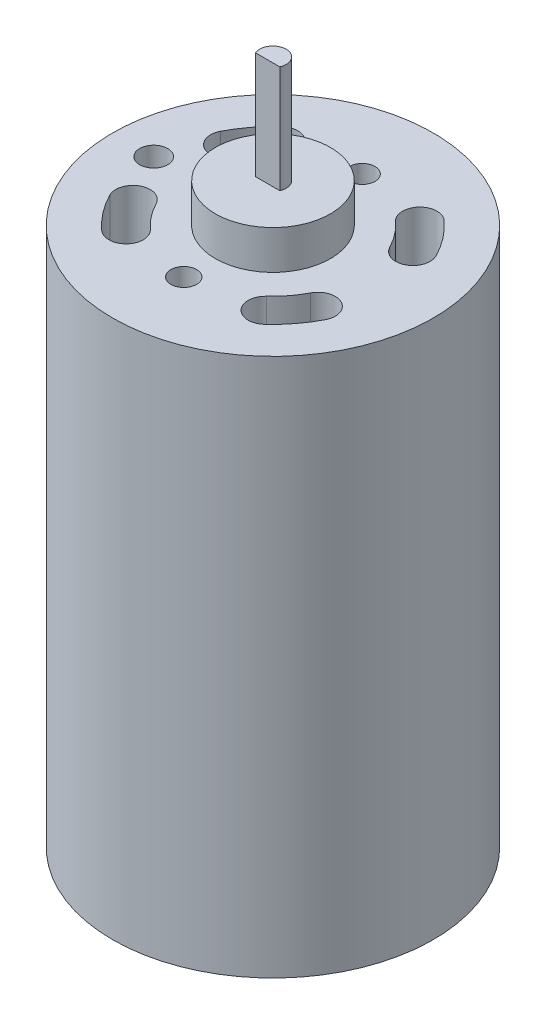
ISO-10303-21;
HEADER;
FILE_DESCRIPTION(('STEP AP214'),'2;1');
FILE_NAME('part.step','',(''),(''),'','','');
FILE_SCHEMA(('AUTOMOTIVE_DESIGN { 1 0 10303 214 1 1 1 1 }'));
ENDSEC;
DATA;
#1=APPLICATION_CONTEXT('core data for automotive mechanical design processes');
#2=APPLICATION_PROTOCOL_DEFINITION('international standard','automotive_design',2000,#1);
#3=PRODUCT_CONTEXT('',#1,'mechanical');
#4=PRODUCT('Part','Part','',(#3));
#5=PRODUCT_RELATED_PRODUCT_CATEGORY('part','',(#4));
#6=PRODUCT_DEFINITION_FORMATION('','',#4);
#7=PRODUCT_DEFINITION_CONTEXT('part definition',#1,'design');
#8=PRODUCT_DEFINITION('design','',#6,#7);
#9=PRODUCT_DEFINITION_SHAPE('','',#8);
#10=(LENGTH_UNIT() NAMED_UNIT(*) SI_UNIT(.MILLI.,.METRE.));
#11=(NAMED_UNIT(*) PLANE_ANGLE_UNIT() SI_UNIT($,.RADIAN.));
#12=(NAMED_UNIT(*) SI_UNIT($,.STERADIAN.) SOLID_ANGLE_UNIT());
#13=UNCERTAINTY_MEASURE_WITH_UNIT(LENGTH_MEASURE(1.E-05),#10,'distance_accuracy_value','');
#14=(GEOMETRIC_REPRESENTATION_CONTEXT(3) GLOBAL_UNCERTAINTY_ASSIGNED_CONTEXT((#13)) GLOBAL_UNIT_ASSIGNED_CONTEXT((#10,
#11,#12)) REPRESENTATION_CONTEXT('',''));
#15=CARTESIAN_POINT('',(0.,0.,0.));
#16=DIRECTION('',(0.,0.,1.));
#17=DIRECTION('',(1.,0.,0.));
#18=AXIS2_PLACEMENT_3D('',#15,#16,#17);
#19=CARTESIAN_POINT('',(3.99516824262446,41.0464,-2.047875));
#20=DIRECTION('',(0.,1.,0.));
#21=DIRECTION('',(0.,0.,1.));
#22=AXIS2_PLACEMENT_3D('',#19,#20,#21);
#23=PLANE('',#22);
#24=CARTESIAN_POINT('',(7.99033648524891,41.0464,-4.09575));
#25=DIRECTION('',(0.,-1.,0.));
#26=DIRECTION('',(0.,0.,1.));
#27=AXIS2_PLACEMENT_3D('',#24,#25,#26);
#28=CIRCLE('',#27,1.4859);
#29=CARTESIAN_POINT('',(9.3126411086918,41.0464,-4.77354738330976));
#30=VERTEX_POINT('',#29);
#31=CARTESIAN_POINT('',(6.66803186180602,41.0464,-3.41795261669024));
#32=VERTEX_POINT('',#31);
#33=EDGE_CURVE('E314',#30,#32,#28,.T.);
#34=ORIENTED_EDGE('',*,*,#33,.F.);
#35=CARTESIAN_POINT('',(0.,41.0464,0.));
#36=DIRECTION('',(0.,-1.,0.));
#37=DIRECTION('',(0.,0.,1.));
#38=AXIS2_PLACEMENT_3D('',#35,#36,#37);
#39=CIRCLE('',#38,10.4648);
#40=CARTESIAN_POINT('',(7.00894362377154,41.0464,-7.77089108910891));
#41=VERTEX_POINT('',#40);
#42=EDGE_CURVE('E292',#41,#30,#39,.T.);
#43=ORIENTED_EDGE('',*,*,#42,.F.);
#44=CARTESIAN_POINT('',(6.01374167719233,41.0464,-6.6675));
#45=DIRECTION('',(0.,-1.,0.));
#46=DIRECTION('',(0.,0.,1.));
#47=AXIS2_PLACEMENT_3D('',#44,#45,#46);
#48=CIRCLE('',#47,1.4859);
#49=CARTESIAN_POINT('',(5.01853973061311,41.0464,-5.56410891089109));
#50=VERTEX_POINT('',#49);
#51=EDGE_CURVE('E300',#50,#41,#48,.T.);
#52=ORIENTED_EDGE('',*,*,#51,.F.);
#53=CARTESIAN_POINT('',(0.,41.0464,0.));
#54=DIRECTION('',(0.,1.,0.));
#55=DIRECTION('',(0.,0.,1.));
#56=AXIS2_PLACEMENT_3D('',#53,#54,#55);
#57=CIRCLE('',#56,7.493);
#58=EDGE_CURVE('E307',#32,#50,#57,.T.);
#59=ORIENTED_EDGE('',*,*,#58,.F.);
#60=EDGE_LOOP('',(#34,#43,#52,#59));
#61=FACE_BOUND('',#60,.T.);
#62=ADVANCED_FACE('F41',(#61),#23,.T.);
#63=CARTESIAN_POINT('',(3.00687083859616,41.0464,3.33375));
#64=DIRECTION('',(0.,1.,0.));
#65=DIRECTION('',(0.,0.,1.));
#66=AXIS2_PLACEMENT_3D('',#63,#64,#65);
#67=PLANE('',#66);
#68=CARTESIAN_POINT('',(0.,41.0464,0.));
#69=DIRECTION('',(0.,1.,0.));
#70=DIRECTION('',(0.,0.,1.));
#71=AXIS2_PLACEMENT_3D('',#68,#69,#70);
#72=CIRCLE('',#71,7.493);
#73=CARTESIAN_POINT('',(5.01853973061312,41.0464,5.56410891089109));
#74=VERTEX_POINT('',#73);
#75=CARTESIAN_POINT('',(6.66803186180602,41.0464,3.41795261669024));
#76=VERTEX_POINT('',#75);
#77=EDGE_CURVE('E321',#74,#76,#72,.T.);
#78=ORIENTED_EDGE('',*,*,#77,.F.);
#79=CARTESIAN_POINT('',(6.01374167719233,41.0464,6.6675));
#80=DIRECTION('',(0.,-1.,0.));
#81=DIRECTION('',(0.,0.,1.));
#82=AXIS2_PLACEMENT_3D('',#79,#80,#81);
#83=CIRCLE('',#82,1.4859);
#84=CARTESIAN_POINT('',(7.00894362377154,41.0464,7.77089108910891));
#85=VERTEX_POINT('',#84);
#86=EDGE_CURVE('E329',#85,#74,#83,.T.);
#87=ORIENTED_EDGE('',*,*,#86,.F.);
#88=CARTESIAN_POINT('',(0.,41.0464,0.));
#89=DIRECTION('',(0.,-1.,0.));
#90=DIRECTION('',(0.,0.,1.));
#91=AXIS2_PLACEMENT_3D('',#88,#89,#90);
#92=CIRCLE('',#91,10.4648);
#93=CARTESIAN_POINT('',(9.3126411086918,41.0464,4.77354738330976));
#94=VERTEX_POINT('',#93);
#95=EDGE_CURVE('E336',#94,#85,#92,.T.);
#96=ORIENTED_EDGE('',*,*,#95,.F.);
#97=CARTESIAN_POINT('',(7.99033648524891,41.0464,4.09575));
#98=DIRECTION('',(0.,-1.,0.));
#99=DIRECTION('',(0.,0.,1.));
#100=AXIS2_PLACEMENT_3D('',#97,#98,#99);
#101=CIRCLE('',#100,1.4859);
#102=EDGE_CURVE('E11',#76,#94,#101,.T.);
#103=ORIENTED_EDGE('',*,*,#102,.F.);
#104=EDGE_LOOP('',(#78,#87,#96,#103));
#105=FACE_BOUND('',#104,.T.);
#106=ADVANCED_FACE('F356',(#105),#67,.T.);
#107=CARTESIAN_POINT('',(7.99033648524891,41.0464,4.09575));
#108=DIRECTION('',(0.,1.,0.));
#109=DIRECTION('',(0.,0.,1.));
#110=AXIS2_PLACEMENT_3D('',#107,#108,#109);
#111=CYLINDRICAL_SURFACE('',#110,1.4859);
#112=CARTESIAN_POINT('',(7.99033648524891,46.482,4.09575));
#113=DIRECTION('',(0.,-1.,0.));
#114=DIRECTION('',(0.,0.,1.));
#115=AXIS2_PLACEMENT_3D('',#112,#113,#114);
#116=CIRCLE('',#115,1.4859);
#117=CARTESIAN_POINT('',(6.66803186180602,46.482,3.41795261669024));
#118=VERTEX_POINT('',#117);
#119=CARTESIAN_POINT('',(9.3126411086918,46.482,4.77354738330976));
#120=VERTEX_POINT('',#119);
#121=EDGE_CURVE('E48',#118,#120,#116,.T.);
#122=ORIENTED_EDGE('',*,*,#121,.F.);
#123=DIRECTION('',(0.,1.,0.));
#124=VECTOR('',#123,1.);
#125=CARTESIAN_POINT('',(6.66803186180602,41.0464,3.41795261669024));
#126=LINE('',#125,#124);
#127=EDGE_CURVE('E318',#76,#118,#126,.T.);
#128=ORIENTED_EDGE('',*,*,#127,.F.);
#129=ORIENTED_EDGE('',*,*,#102,.T.);
#130=DIRECTION('',(0.,1.,0.));
#131=VECTOR('',#130,1.);
#132=CARTESIAN_POINT('',(9.3126411086918,41.0464,4.77354738330976));
#133=LINE('',#132,#131);
#134=EDGE_CURVE('E338',#94,#120,#133,.T.);
#135=ORIENTED_EDGE('',*,*,#134,.T.);
#136=EDGE_LOOP('',(#122,#128,#129,#135));
#137=FACE_BOUND('',#136,.T.);
#138=ADVANCED_FACE('F341',(#137),#111,.F.);
#139=CARTESIAN_POINT('',(0.,41.0464,0.));
#140=DIRECTION('',(0.,1.,0.));
#141=DIRECTION('',(0.,0.,1.));
#142=AXIS2_PLACEMENT_3D('',#139,#140,#141);
#143=CYLINDRICAL_SURFACE('',#142,10.4648);
#144=CARTESIAN_POINT('',(0.,46.482,0.));
#145=DIRECTION('',(0.,-1.,0.));
#146=DIRECTION('',(0.,0.,1.));
#147=AXIS2_PLACEMENT_3D('',#144,#145,#146);
#148=CIRCLE('',#147,10.4648);
#149=CARTESIAN_POINT('',(7.00894362377154,46.482,7.77089108910891));
#150=VERTEX_POINT('',#149);
#151=EDGE_CURVE('E334',#120,#150,#148,.T.);
#152=ORIENTED_EDGE('',*,*,#151,.F.);
#153=ORIENTED_EDGE('',*,*,#134,.F.);
#154=ORIENTED_EDGE('',*,*,#95,.T.);
#155=DIRECTION('',(0.,1.,0.));
#156=VECTOR('',#155,1.);
#157=CARTESIAN_POINT('',(7.00894362377154,41.0464,7.77089108910891));
#158=LINE('',#157,#156);
#159=EDGE_CURVE('E331',#85,#150,#158,.T.);
#160=ORIENTED_EDGE('',*,*,#159,.T.);
#161=EDGE_LOOP('',(#152,#153,#154,#160));
#162=FACE_BOUND('',#161,.T.);
#163=ADVANCED_FACE('F343',(#162),#143,.F.);
#164=CARTESIAN_POINT('',(6.01374167719233,41.0464,6.6675));
#165=DIRECTION('',(0.,1.,0.));
#166=DIRECTION('',(0.,0.,1.));
#167=AXIS2_PLACEMENT_3D('',#164,#165,#166);
#168=CYLINDRICAL_SURFACE('',#167,1.4859);
#169=CARTESIAN_POINT('',(6.01374167719233,46.482,6.6675));
#170=DIRECTION('',(0.,-1.,0.));
#171=DIRECTION('',(0.,0.,1.));
#172=AXIS2_PLACEMENT_3D('',#169,#170,#171);
#173=CIRCLE('',#172,1.4859);
#174=CARTESIAN_POINT('',(5.01853973061312,46.482,5.56410891089109));
#175=VERTEX_POINT('',#174);
#176=EDGE_CURVE('E327',#150,#175,#173,.T.);
#177=ORIENTED_EDGE('',*,*,#176,.F.);
#178=ORIENTED_EDGE('',*,*,#159,.F.);
#179=ORIENTED_EDGE('',*,*,#86,.T.);
#180=DIRECTION('',(0.,1.,0.));
#181=VECTOR('',#180,1.);
#182=CARTESIAN_POINT('',(5.01853973061312,41.0464,5.56410891089109));
#183=LINE('',#182,#181);
#184=EDGE_CURVE('E324',#74,#175,#183,.T.);
#185=ORIENTED_EDGE('',*,*,#184,.T.);
#186=EDGE_LOOP('',(#177,#178,#179,#185));
#187=FACE_BOUND('',#186,.T.);
#188=ADVANCED_FACE('F350',(#187),#168,.F.);
#189=CARTESIAN_POINT('',(0.,41.0464,0.));
#190=DIRECTION('',(0.,1.,0.));
#191=DIRECTION('',(0.,0.,1.));
#192=AXIS2_PLACEMENT_3D('',#189,#190,#191);
#193=CYLINDRICAL_SURFACE('',#192,7.493);
#194=CARTESIAN_POINT('',(0.,46.482,0.));
#195=DIRECTION('',(0.,1.,0.));
#196=DIRECTION('',(0.,0.,1.));
#197=AXIS2_PLACEMENT_3D('',#194,#195,#196);
#198=CIRCLE('',#197,7.493);
#199=EDGE_CURVE('E316',#175,#118,#198,.T.);
#200=ORIENTED_EDGE('',*,*,#199,.F.);
#201=ORIENTED_EDGE('',*,*,#184,.F.);
#202=ORIENTED_EDGE('',*,*,#77,.T.);
#203=ORIENTED_EDGE('',*,*,#127,.T.);
#204=EDGE_LOOP('',(#200,#201,#202,#203));
#205=FACE_BOUND('',#204,.T.);
#206=ADVANCED_FACE('F354',(#205),#193,.T.);
#207=CARTESIAN_POINT('',(7.99033648524891,41.0464,-4.09575));
#208=DIRECTION('',(0.,1.,0.));
#209=DIRECTION('',(0.,0.,1.));
#210=AXIS2_PLACEMENT_3D('',#207,#208,#209);
#211=CYLINDRICAL_SURFACE('',#210,1.4859);
#212=CARTESIAN_POINT('',(7.99033648524891,46.482,-4.09575));
#213=DIRECTION('',(0.,-1.,0.));
#214=DIRECTION('',(0.,0.,1.));
#215=AXIS2_PLACEMENT_3D('',#212,#213,#214);
#216=CIRCLE('',#215,1.4859);
#217=CARTESIAN_POINT('',(9.3126411086918,46.482,-4.77354738330976));
#218=VERTEX_POINT('',#217);
#219=CARTESIAN_POINT('',(6.66803186180602,46.482,-3.41795261669024));
#220=VERTEX_POINT('',#219);
#221=EDGE_CURVE('E312',#218,#220,#216,.T.);
#222=ORIENTED_EDGE('',*,*,#221,.F.);
#223=DIRECTION('',(0.,1.,0.));
#224=VECTOR('',#223,1.);
#225=CARTESIAN_POINT('',(9.3126411086918,41.0464,-4.77354738330976));
#226=LINE('',#225,#224);
#227=EDGE_CURVE('E289',#30,#218,#226,.T.);
#228=ORIENTED_EDGE('',*,*,#227,.F.);
#229=ORIENTED_EDGE('',*,*,#33,.T.);
#230=DIRECTION('',(0.,1.,0.));
#231=VECTOR('',#230,1.);
#232=CARTESIAN_POINT('',(6.66803186180602,41.0464,-3.41795261669024));
#233=LINE('',#232,#231);
#234=EDGE_CURVE('E309',#32,#220,#233,.T.);
#235=ORIENTED_EDGE('',*,*,#234,.T.);
#236=EDGE_LOOP('',(#222,#228,#229,#235));
#237=FACE_BOUND('',#236,.T.);
#238=ADVANCED_FACE('F371',(#237),#211,.F.);
#239=CARTESIAN_POINT('',(0.,41.0464,0.));
#240=DIRECTION('',(0.,1.,0.));
#241=DIRECTION('',(0.,0.,1.));
#242=AXIS2_PLACEMENT_3D('',#239,#240,#241);
#243=CYLINDRICAL_SURFACE('',#242,7.493);
#244=CARTESIAN_POINT('',(0.,46.482,0.));
#245=DIRECTION('',(0.,1.,0.));
#246=DIRECTION('',(0.,0.,1.));
#247=AXIS2_PLACEMENT_3D('',#244,#245,#246);
#248=CIRCLE('',#247,7.493);
#249=CARTESIAN_POINT('',(5.01853973061311,46.482,-5.56410891089109));
#250=VERTEX_POINT('',#249);
#251=EDGE_CURVE('E305',#220,#250,#248,.T.);
#252=ORIENTED_EDGE('',*,*,#251,.F.);
#253=ORIENTED_EDGE('',*,*,#234,.F.);
#254=ORIENTED_EDGE('',*,*,#58,.T.);
#255=DIRECTION('',(0.,1.,0.));
#256=VECTOR('',#255,1.);
#257=CARTESIAN_POINT('',(5.01853973061311,41.0464,-5.56410891089109));
#258=LINE('',#257,#256);
#259=EDGE_CURVE('E302',#50,#250,#258,.T.);
#260=ORIENTED_EDGE('',*,*,#259,.T.);
#261=EDGE_LOOP('',(#252,#253,#254,#260));
#262=FACE_BOUND('',#261,.T.);
#263=ADVANCED_FACE('F374',(#262),#243,.T.);
#264=CARTESIAN_POINT('',(6.01374167719233,41.0464,-6.6675));
#265=DIRECTION('',(0.,1.,0.));
#266=DIRECTION('',(0.,0.,1.));
#267=AXIS2_PLACEMENT_3D('',#264,#265,#266);
#268=CYLINDRICAL_SURFACE('',#267,1.4859);
#269=CARTESIAN_POINT('',(6.01374167719233,46.482,-6.6675));
#270=DIRECTION('',(0.,-1.,0.));
#271=DIRECTION('',(0.,0.,1.));
#272=AXIS2_PLACEMENT_3D('',#269,#270,#271);
#273=CIRCLE('',#272,1.4859);
#274=CARTESIAN_POINT('',(7.00894362377154,46.482,-7.77089108910891));
#275=VERTEX_POINT('',#274);
#276=EDGE_CURVE('E298',#250,#275,#273,.T.);
#277=ORIENTED_EDGE('',*,*,#276,.F.);
#278=ORIENTED_EDGE('',*,*,#259,.F.);
#279=ORIENTED_EDGE('',*,*,#51,.T.);
#280=DIRECTION('',(0.,1.,0.));
#281=VECTOR('',#280,1.);
#282=CARTESIAN_POINT('',(7.00894362377154,41.0464,-7.77089108910891));
#283=LINE('',#282,#281);
#284=EDGE_CURVE('E295',#41,#275,#283,.T.);
#285=ORIENTED_EDGE('',*,*,#284,.T.);
#286=EDGE_LOOP('',(#277,#278,#279,#285));
#287=FACE_BOUND('',#286,.T.);
#288=ADVANCED_FACE('F378',(#287),#268,.F.);
#289=CARTESIAN_POINT('',(0.,41.0464,0.));
#290=DIRECTION('',(0.,1.,0.));
#291=DIRECTION('',(0.,0.,1.));
#292=AXIS2_PLACEMENT_3D('',#289,#290,#291);
#293=CYLINDRICAL_SURFACE('',#292,10.4648);
#294=CARTESIAN_POINT('',(0.,46.482,0.));
#295=DIRECTION('',(0.,-1.,0.));
#296=DIRECTION('',(0.,0.,1.));
#297=AXIS2_PLACEMENT_3D('',#294,#295,#296);
#298=CIRCLE('',#297,10.4648);
#299=EDGE_CURVE('E275',#275,#218,#298,.T.);
#300=ORIENTED_EDGE('',*,*,#299,.F.);
#301=ORIENTED_EDGE('',*,*,#284,.F.);
#302=ORIENTED_EDGE('',*,*,#42,.T.);
#303=ORIENTED_EDGE('',*,*,#227,.T.);
#304=EDGE_LOOP('',(#300,#301,#302,#303));
#305=FACE_BOUND('',#304,.T.);
#306=ADVANCED_FACE('F382',(#305),#293,.F.);
#307=CARTESIAN_POINT('',(0.,46.482,0.));
#308=DIRECTION('',(0.,-1.,0.));
#309=DIRECTION('',(0.,0.,-1.));
#310=AXIS2_PLACEMENT_3D('',#307,#308,#309);
#311=CYLINDRICAL_SURFACE('',#310,13.843);
#312=CARTESIAN_POINT('',(0.,46.482,0.));
#313=DIRECTION('',(0.,1.,0.));
#314=DIRECTION('',(0.,0.,1.));
#315=AXIS2_PLACEMENT_3D('',#312,#313,#314);
#316=CIRCLE('',#315,13.843);
#317=CARTESIAN_POINT('',(0.,46.482,13.843));
#318=VERTEX_POINT('',#317);
#319=EDGE_CURVE('E282',#318,#318,#316,.T.);
#320=ORIENTED_EDGE('',*,*,#319,.F.);
#321=EDGE_LOOP('',(#320));
#322=FACE_BOUND('',#321,.T.);
#323=CARTESIAN_POINT('',(0.,0.,0.));
#324=DIRECTION('',(0.,1.,0.));
#325=DIRECTION('',(0.,0.,1.));
#326=AXIS2_PLACEMENT_3D('',#323,#324,#325);
#327=CIRCLE('',#326,13.843);
#328=CARTESIAN_POINT('',(0.,0.,13.843));
#329=VERTEX_POINT('',#328);
#330=EDGE_CURVE('E279',#329,#329,#327,.T.);
#331=ORIENTED_EDGE('',*,*,#330,.T.);
#332=EDGE_LOOP('',(#331));
#333=FACE_BOUND('',#332,.T.);
#334=ADVANCED_FACE('F386',(#322,#333),#311,.T.);
#335=CARTESIAN_POINT('',(0.,46.482,0.));
#336=DIRECTION('',(0.,1.,0.));
#337=DIRECTION('',(0.,0.,1.));
#338=AXIS2_PLACEMENT_3D('',#335,#336,#337);
#339=PLANE('',#338);
#340=ORIENTED_EDGE('',*,*,#221,.T.);
#341=ORIENTED_EDGE('',*,*,#251,.T.);
#342=ORIENTED_EDGE('',*,*,#276,.T.);
#343=ORIENTED_EDGE('',*,*,#299,.T.);
#344=EDGE_LOOP('',(#340,#341,#342,#343));
#345=FACE_BOUND('',#344,.T.);
#346=ORIENTED_EDGE('',*,*,#199,.T.);
#347=ORIENTED_EDGE('',*,*,#121,.T.);
#348=ORIENTED_EDGE('',*,*,#151,.T.);
#349=ORIENTED_EDGE('',*,*,#176,.T.);
#350=EDGE_LOOP('',(#346,#347,#348,#349));
#351=FACE_BOUND('',#350,.T.);
#352=CARTESIAN_POINT('',(0.,46.482,7.70255));
#353=DIRECTION('',(0.,1.,0.));
#354=DIRECTION('',(0.,0.,1.));
#355=AXIS2_PLACEMENT_3D('',#352,#353,#354);
#356=CIRCLE('',#355,1.11125);
#357=CARTESIAN_POINT('',(0.,46.482,8.8138));
#358=VERTEX_POINT('',#357);
#359=EDGE_CURVE('E237',#358,#358,#356,.T.);
#360=ORIENTED_EDGE('',*,*,#359,.F.);
#361=EDGE_LOOP('',(#360));
#362=FACE_BOUND('',#361,.T.);
#363=CARTESIAN_POINT('',(-10.29335,46.482,0.));
#364=DIRECTION('',(0.,1.,0.));
#365=DIRECTION('',(0.,0.,1.));
#366=AXIS2_PLACEMENT_3D('',#363,#364,#365);
#367=CIRCLE('',#366,1.21285);
#368=CARTESIAN_POINT('',(-10.29335,46.482,1.21285));
#369=VERTEX_POINT('',#368);
#370=EDGE_CURVE('E191',#369,#369,#367,.T.);
#371=ORIENTED_EDGE('',*,*,#370,.F.);
#372=EDGE_LOOP('',(#371));
#373=FACE_BOUND('',#372,.T.);
#374=CARTESIAN_POINT('',(0.,46.482,0.));
#375=DIRECTION('',(0.,-1.,0.));
#376=DIRECTION('',(0.,0.,1.));
#377=AXIS2_PLACEMENT_3D('',#374,#375,#376);
#378=CIRCLE('',#377,7.493);
#379=CARTESIAN_POINT('',(-5.01853973061312,46.482,5.56410891089109));
#380=VERTEX_POINT('',#379);
#381=CARTESIAN_POINT('',(-6.66803186180602,46.482,3.41795261669024));
#382=VERTEX_POINT('',#381);
#383=EDGE_CURVE('E165',#380,#382,#378,.T.);
#384=ORIENTED_EDGE('',*,*,#383,.F.);
#385=CARTESIAN_POINT('',(-6.01374167719233,46.482,6.6675));
#386=DIRECTION('',(0.,1.,0.));
#387=DIRECTION('',(0.,0.,1.));
#388=AXIS2_PLACEMENT_3D('',#385,#386,#387);
#389=CIRCLE('',#388,1.4859);
#390=CARTESIAN_POINT('',(-7.00894362377154,46.482,7.77089108910891));
#391=VERTEX_POINT('',#390);
#392=EDGE_CURVE('E176',#391,#380,#389,.T.);
#393=ORIENTED_EDGE('',*,*,#392,.F.);
#394=CARTESIAN_POINT('',(0.,46.482,0.));
#395=DIRECTION('',(0.,1.,0.));
#396=DIRECTION('',(0.,0.,1.));
#397=AXIS2_PLACEMENT_3D('',#394,#395,#396);
#398=CIRCLE('',#397,10.4648);
#399=CARTESIAN_POINT('',(-9.3126411086918,46.482,4.77354738330976));
#400=VERTEX_POINT('',#399);
#401=EDGE_CURVE('E181',#400,#391,#398,.T.);
#402=ORIENTED_EDGE('',*,*,#401,.F.);
#403=CARTESIAN_POINT('',(-7.99033648524891,46.482,4.09575));
#404=DIRECTION('',(0.,1.,0.));
#405=DIRECTION('',(0.,0.,1.));
#406=AXIS2_PLACEMENT_3D('',#403,#404,#405);
#407=CIRCLE('',#406,1.4859);
#408=EDGE_CURVE('E187',#382,#400,#407,.T.);
#409=ORIENTED_EDGE('',*,*,#408,.F.);
#410=EDGE_LOOP('',(#384,#393,#402,#409));
#411=FACE_BOUND('',#410,.T.);
#412=CARTESIAN_POINT('',(-7.99033648524891,46.482,-4.09575));
#413=DIRECTION('',(0.,1.,0.));
#414=DIRECTION('',(0.,0.,1.));
#415=AXIS2_PLACEMENT_3D('',#412,#413,#414);
#416=CIRCLE('',#415,1.4859);
#417=CARTESIAN_POINT('',(-9.3126411086918,46.482,-4.77354738330976));
#418=VERTEX_POINT('',#417);
#419=CARTESIAN_POINT('',(-6.66803186180602,46.482,-3.41795261669024));
#420=VERTEX_POINT('',#419);
#421=EDGE_CURVE('E173',#418,#420,#416,.T.);
#422=ORIENTED_EDGE('',*,*,#421,.F.);
#423=CARTESIAN_POINT('',(0.,46.482,0.));
#424=DIRECTION('',(0.,1.,0.));
#425=DIRECTION('',(0.,0.,1.));
#426=AXIS2_PLACEMENT_3D('',#423,#424,#425);
#427=CIRCLE('',#426,10.4648);
#428=CARTESIAN_POINT('',(-7.00894362377154,46.482,-7.77089108910891));
#429=VERTEX_POINT('',#428);
#430=EDGE_CURVE('E216',#429,#418,#427,.T.);
#431=ORIENTED_EDGE('',*,*,#430,.F.);
#432=CARTESIAN_POINT('',(-6.01374167719233,46.482,-6.6675));
#433=DIRECTION('',(0.,1.,0.));
#434=DIRECTION('',(0.,0.,1.));
#435=AXIS2_PLACEMENT_3D('',#432,#433,#434);
#436=CIRCLE('',#435,1.4859);
#437=CARTESIAN_POINT('',(-5.01853973061311,46.482,-5.56410891089109));
#438=VERTEX_POINT('',#437);
#439=EDGE_CURVE('E219',#438,#429,#436,.T.);
#440=ORIENTED_EDGE('',*,*,#439,.F.);
#441=CARTESIAN_POINT('',(0.,46.482,0.));
#442=DIRECTION('',(0.,-1.,0.));
#443=DIRECTION('',(0.,0.,1.));
#444=AXIS2_PLACEMENT_3D('',#441,#442,#443);
#445=CIRCLE('',#444,7.493);
#446=EDGE_CURVE('E223',#420,#438,#445,.T.);
#447=ORIENTED_EDGE('',*,*,#446,.F.);
#448=EDGE_LOOP('',(#422,#431,#440,#447));
#449=FACE_BOUND('',#448,.T.);
#450=CARTESIAN_POINT('',(0.,46.482,-7.70255));
#451=DIRECTION('',(0.,1.,0.));
#452=DIRECTION('',(0.,0.,1.));
#453=AXIS2_PLACEMENT_3D('',#450,#451,#452);
#454=CIRCLE('',#453,1.11125);
#455=CARTESIAN_POINT('',(0.,46.482,-6.5913));
#456=VERTEX_POINT('',#455);
#457=EDGE_CURVE('E240',#456,#456,#454,.T.);
#458=ORIENTED_EDGE('',*,*,#457,.F.);
#459=EDGE_LOOP('',(#458));
#460=FACE_BOUND('',#459,.T.);
#461=CARTESIAN_POINT('',(0.,46.482,0.));
#462=DIRECTION('',(0.,1.,0.));
#463=DIRECTION('',(0.,0.,1.));
#464=AXIS2_PLACEMENT_3D('',#461,#462,#463);
#465=CIRCLE('',#464,4.9657);
#466=CARTESIAN_POINT('',(0.,46.482,4.9657));
#467=VERTEX_POINT('',#466);
#468=EDGE_CURVE('E276',#467,#467,#465,.T.);
#469=ORIENTED_EDGE('',*,*,#468,.F.);
#470=EDGE_LOOP('',(#469));
#471=FACE_BOUND('',#470,.T.);
#472=ORIENTED_EDGE('',*,*,#319,.T.);
#473=EDGE_LOOP('',(#472));
#474=FACE_BOUND('',#473,.T.);
#475=ADVANCED_FACE('F184',(#345,#351,#362,#373,#411,#449,#460,#471,#474),#339,.T.);
#476=CARTESIAN_POINT('',(0.,0.,0.));
#477=DIRECTION('',(0.,1.,0.));
#478=DIRECTION('',(0.,0.,1.));
#479=AXIS2_PLACEMENT_3D('',#476,#477,#478);
#480=PLANE('',#479);
#481=CARTESIAN_POINT('',(0.,0.,0.));
#482=DIRECTION('',(0.,-1.,0.));
#483=DIRECTION('',(0.,0.,-1.));
#484=AXIS2_PLACEMENT_3D('',#481,#482,#483);
#485=CIRCLE('',#484,4.953);
#486=CARTESIAN_POINT('',(0.,0.,-4.953));
#487=VERTEX_POINT('',#486);
#488=EDGE_CURVE('E272',#487,#487,#485,.T.);
#489=ORIENTED_EDGE('',*,*,#488,.F.);
#490=EDGE_LOOP('',(#489));
#491=FACE_BOUND('',#490,.T.);
#492=ORIENTED_EDGE('',*,*,#330,.F.);
#493=EDGE_LOOP('',(#492));
#494=FACE_BOUND('',#493,.T.);
#495=ADVANCED_FACE('F391',(#491,#494),#480,.F.);
#496=CARTESIAN_POINT('',(0.,49.8348,0.));
#497=DIRECTION('',(0.,-1.,0.));
#498=DIRECTION('',(0.,0.,-1.));
#499=AXIS2_PLACEMENT_3D('',#496,#497,#498);
#500=CYLINDRICAL_SURFACE('',#499,4.9657);
#501=CARTESIAN_POINT('',(0.,49.8348,0.));
#502=DIRECTION('',(0.,1.,0.));
#503=DIRECTION('',(0.,0.,1.));
#504=AXIS2_PLACEMENT_3D('',#501,#502,#503);
#505=CIRCLE('',#504,4.9657);
#506=CARTESIAN_POINT('',(0.,49.8348,4.9657));
#507=VERTEX_POINT('',#506);
#508=EDGE_CURVE('E271',#507,#507,#505,.T.);
#509=ORIENTED_EDGE('',*,*,#508,.F.);
#510=EDGE_LOOP('',(#509));
#511=FACE_BOUND('',#510,.T.);
#512=ORIENTED_EDGE('',*,*,#468,.T.);
#513=EDGE_LOOP('',(#512));
#514=FACE_BOUND('',#513,.T.);
#515=ADVANCED_FACE('F394',(#511,#514),#500,.T.);
#516=CARTESIAN_POINT('',(0.,49.8348,0.));
#517=DIRECTION('',(0.,1.,0.));
#518=DIRECTION('',(0.,0.,1.));
#519=AXIS2_PLACEMENT_3D('',#516,#517,#518);
#520=PLANE('',#519);
#521=CARTESIAN_POINT('',(0.,49.8348,0.));
#522=DIRECTION('',(0.,1.,0.));
#523=DIRECTION('',(0.,0.,1.));
#524=AXIS2_PLACEMENT_3D('',#521,#522,#523);
#525=CIRCLE('',#524,1.143);
#526=CARTESIAN_POINT('',(1.04757680386691,49.8348,0.4572));
#527=VERTEX_POINT('',#526);
#528=CARTESIAN_POINT('',(-1.04757680386691,49.8348,0.4572));
#529=VERTEX_POINT('',#528);
#530=EDGE_CURVE('E249',#527,#529,#525,.T.);
#531=ORIENTED_EDGE('',*,*,#530,.F.);
#532=DIRECTION('',(1.,0.,0.));
#533=VECTOR('',#532,1.);
#534=CARTESIAN_POINT('',(-1.04757680386691,49.8348,0.4572));
#535=LINE('',#534,#533);
#536=EDGE_CURVE('E256',#529,#527,#535,.T.);
#537=ORIENTED_EDGE('',*,*,#536,.F.);
#538=EDGE_LOOP('',(#531,#537));
#539=FACE_BOUND('',#538,.T.);
#540=ORIENTED_EDGE('',*,*,#508,.T.);
#541=EDGE_LOOP('',(#540));
#542=FACE_BOUND('',#541,.T.);
#543=ADVANCED_FACE('F401',(#539,#542),#520,.T.);
#544=CARTESIAN_POINT('',(0.,-2.8956,0.));
#545=DIRECTION('',(0.,1.,0.));
#546=DIRECTION('',(0.,0.,1.));
#547=AXIS2_PLACEMENT_3D('',#544,#545,#546);
#548=CYLINDRICAL_SURFACE('',#547,4.953);
#549=CARTESIAN_POINT('',(0.,-2.8956,0.));
#550=DIRECTION('',(0.,-1.,0.));
#551=DIRECTION('',(0.,0.,-1.));
#552=AXIS2_PLACEMENT_3D('',#549,#550,#551);
#553=CIRCLE('',#552,4.953);
#554=CARTESIAN_POINT('',(0.,-2.8956,-4.953));
#555=VERTEX_POINT('',#554);
#556=EDGE_CURVE('E268',#555,#555,#553,.T.);
#557=ORIENTED_EDGE('',*,*,#556,.F.);
#558=EDGE_LOOP('',(#557));
#559=FACE_BOUND('',#558,.T.);
#560=ORIENTED_EDGE('',*,*,#488,.T.);
#561=EDGE_LOOP('',(#560));
#562=FACE_BOUND('',#561,.T.);
#563=ADVANCED_FACE('F405',(#559,#562),#548,.T.);
#564=CARTESIAN_POINT('',(0.,-2.8956,0.));
#565=DIRECTION('',(0.,-1.,0.));
#566=DIRECTION('',(0.,0.,-1.));
#567=AXIS2_PLACEMENT_3D('',#564,#565,#566);
#568=PLANE('',#567);
#569=ORIENTED_EDGE('',*,*,#556,.T.);
#570=EDGE_LOOP('',(#569));
#571=FACE_BOUND('',#570,.T.);
#572=ADVANCED_FACE('F409',(#571),#568,.T.);
#573=CARTESIAN_POINT('',(0.,59.0931,0.));
#574=DIRECTION('',(0.,-1.,0.));
#575=DIRECTION('',(0.,0.,-1.));
#576=AXIS2_PLACEMENT_3D('',#573,#574,#575);
#577=CYLINDRICAL_SURFACE('',#576,1.143);
#578=ORIENTED_EDGE('',*,*,#530,.T.);
#579=DIRECTION('',(0.,-1.,0.));
#580=VECTOR('',#579,1.);
#581=CARTESIAN_POINT('',(-1.04757680386691,59.0931,0.4572));
#582=LINE('',#581,#580);
#583=CARTESIAN_POINT('',(-1.04757680386691,59.0931,0.4572));
#584=VERTEX_POINT('',#583);
#585=EDGE_CURVE('E265',#584,#529,#582,.T.);
#586=ORIENTED_EDGE('',*,*,#585,.F.);
#587=CARTESIAN_POINT('',(0.,59.0931,0.));
#588=DIRECTION('',(0.,1.,0.));
#589=DIRECTION('',(0.,0.,1.));
#590=AXIS2_PLACEMENT_3D('',#587,#588,#589);
#591=CIRCLE('',#590,1.143);
#592=CARTESIAN_POINT('',(1.04757680386691,59.0931,0.4572));
#593=VERTEX_POINT('',#592);
#594=EDGE_CURVE('E252',#593,#584,#591,.T.);
#595=ORIENTED_EDGE('',*,*,#594,.F.);
#596=DIRECTION('',(0.,-1.,0.));
#597=VECTOR('',#596,1.);
#598=CARTESIAN_POINT('',(1.04757680386691,59.0931,0.4572));
#599=LINE('',#598,#597);
#600=EDGE_CURVE('E258',#593,#527,#599,.T.);
#601=ORIENTED_EDGE('',*,*,#600,.T.);
#602=EDGE_LOOP('',(#578,#586,#595,#601));
#603=FACE_BOUND('',#602,.T.);
#604=ADVANCED_FACE('F413',(#603),#577,.T.);
#605=CARTESIAN_POINT('',(-1.04757680386691,59.0931,0.4572));
#606=DIRECTION('',(0.,0.,-1.));
#607=DIRECTION('',(-1.,0.,0.));
#608=AXIS2_PLACEMENT_3D('',#605,#606,#607);
#609=PLANE('',#608);
#610=ORIENTED_EDGE('',*,*,#536,.T.);
#611=ORIENTED_EDGE('',*,*,#600,.F.);
#612=DIRECTION('',(1.,0.,0.));
#613=VECTOR('',#612,1.);
#614=CARTESIAN_POINT('',(-1.04757680386691,59.0931,0.4572));
#615=LINE('',#614,#613);
#616=EDGE_CURVE('E255',#584,#593,#615,.T.);
#617=ORIENTED_EDGE('',*,*,#616,.F.);
#618=ORIENTED_EDGE('',*,*,#585,.T.);
#619=EDGE_LOOP('',(#610,#611,#617,#618));
#620=FACE_BOUND('',#619,.T.);
#621=ADVANCED_FACE('F417',(#620),#609,.F.);
#622=CARTESIAN_POINT('',(0.,59.0931,0.));
#623=DIRECTION('',(0.,1.,0.));
#624=DIRECTION('',(0.,0.,1.));
#625=AXIS2_PLACEMENT_3D('',#622,#623,#624);
#626=PLANE('',#625);
#627=ORIENTED_EDGE('',*,*,#594,.T.);
#628=ORIENTED_EDGE('',*,*,#616,.T.);
#629=EDGE_LOOP('',(#627,#628));
#630=FACE_BOUND('',#629,.T.);
#631=ADVANCED_FACE('F421',(#630),#626,.T.);
#632=CARTESIAN_POINT('',(0.,41.0464,-7.70255));
#633=DIRECTION('',(0.,1.,0.));
#634=DIRECTION('',(0.,0.,1.));
#635=AXIS2_PLACEMENT_3D('',#632,#633,#634);
#636=CYLINDRICAL_SURFACE('',#635,1.11125);
#637=CARTESIAN_POINT('',(0.,41.0464,-7.70255));
#638=DIRECTION('',(0.,1.,0.));
#639=DIRECTION('',(0.,0.,1.));
#640=AXIS2_PLACEMENT_3D('',#637,#638,#639);
#641=CIRCLE('',#640,1.11125);
#642=CARTESIAN_POINT('',(0.,41.0464,-6.5913));
#643=VERTEX_POINT('',#642);
#644=EDGE_CURVE('E246',#643,#643,#641,.T.);
#645=ORIENTED_EDGE('',*,*,#644,.F.);
#646=EDGE_LOOP('',(#645));
#647=FACE_BOUND('',#646,.T.);
#648=ORIENTED_EDGE('',*,*,#457,.T.);
#649=EDGE_LOOP('',(#648));
#650=FACE_BOUND('',#649,.T.);
#651=ADVANCED_FACE('F425',(#647,#650),#636,.F.);
#652=CARTESIAN_POINT('',(0.,41.0464,-7.70255));
#653=DIRECTION('',(0.,1.,0.));
#654=DIRECTION('',(0.,0.,1.));
#655=AXIS2_PLACEMENT_3D('',#652,#653,#654);
#656=PLANE('',#655);
#657=ORIENTED_EDGE('',*,*,#644,.T.);
#658=EDGE_LOOP('',(#657));
#659=FACE_BOUND('',#658,.T.);
#660=ADVANCED_FACE('F429',(#659),#656,.T.);
#661=CARTESIAN_POINT('',(-7.99033648524891,41.0464,-4.09575));
#662=DIRECTION('',(0.,1.,0.));
#663=DIRECTION('',(0.,0.,1.));
#664=AXIS2_PLACEMENT_3D('',#661,#662,#663);
#665=CYLINDRICAL_SURFACE('',#664,1.4859);
#666=ORIENTED_EDGE('',*,*,#421,.T.);
#667=DIRECTION('',(0.,1.,0.));
#668=VECTOR('',#667,1.);
#669=CARTESIAN_POINT('',(-6.66803186180602,41.0464,-3.41795261669024));
#670=LINE('',#669,#668);
#671=CARTESIAN_POINT('',(-6.66803186180602,41.0464,-3.41795261669024));
#672=VERTEX_POINT('',#671);
#673=EDGE_CURVE('E206',#672,#420,#670,.T.);
#674=ORIENTED_EDGE('',*,*,#673,.F.);
#675=CARTESIAN_POINT('',(-7.99033648524891,41.0464,-4.09575));
#676=DIRECTION('',(0.,1.,0.));
#677=DIRECTION('',(0.,0.,1.));
#678=AXIS2_PLACEMENT_3D('',#675,#676,#677);
#679=CIRCLE('',#678,1.4859);
#680=CARTESIAN_POINT('',(-9.3126411086918,41.0464,-4.77354738330976));
#681=VERTEX_POINT('',#680);
#682=EDGE_CURVE('E220',#681,#672,#679,.T.);
#683=ORIENTED_EDGE('',*,*,#682,.F.);
#684=DIRECTION('',(0.,1.,0.));
#685=VECTOR('',#684,1.);
#686=CARTESIAN_POINT('',(-9.3126411086918,41.0464,-4.77354738330976));
#687=LINE('',#686,#685);
#688=EDGE_CURVE('E214',#681,#418,#687,.T.);
#689=ORIENTED_EDGE('',*,*,#688,.T.);
#690=EDGE_LOOP('',(#666,#674,#683,#689));
#691=FACE_BOUND('',#690,.T.);
#692=ADVANCED_FACE('F433',(#691),#665,.F.);
#693=CARTESIAN_POINT('',(0.,41.0464,0.));
#694=DIRECTION('',(0.,1.,0.));
#695=DIRECTION('',(0.,0.,1.));
#696=AXIS2_PLACEMENT_3D('',#693,#694,#695);
#697=CYLINDRICAL_SURFACE('',#696,10.4648);
#698=ORIENTED_EDGE('',*,*,#430,.T.);
#699=ORIENTED_EDGE('',*,*,#688,.F.);
#700=CARTESIAN_POINT('',(0.,41.0464,0.));
#701=DIRECTION('',(0.,1.,0.));
#702=DIRECTION('',(0.,0.,1.));
#703=AXIS2_PLACEMENT_3D('',#700,#701,#702);
#704=CIRCLE('',#703,10.4648);
#705=CARTESIAN_POINT('',(-7.00894362377154,41.0464,-7.77089108910891));
#706=VERTEX_POINT('',#705);
#707=EDGE_CURVE('E209',#706,#681,#704,.T.);
#708=ORIENTED_EDGE('',*,*,#707,.F.);
#709=DIRECTION('',(0.,1.,0.));
#710=VECTOR('',#709,1.);
#711=CARTESIAN_POINT('',(-7.00894362377154,41.0464,-7.77089108910891));
#712=LINE('',#711,#710);
#713=EDGE_CURVE('E212',#706,#429,#712,.T.);
#714=ORIENTED_EDGE('',*,*,#713,.T.);
#715=EDGE_LOOP('',(#698,#699,#708,#714));
#716=FACE_BOUND('',#715,.T.);
#717=ADVANCED_FACE('F457',(#716),#697,.F.);
#718=CARTESIAN_POINT('',(-6.01374167719233,41.0464,-6.6675));
#719=DIRECTION('',(0.,1.,0.));
#720=DIRECTION('',(0.,0.,1.));
#721=AXIS2_PLACEMENT_3D('',#718,#719,#720);
#722=CYLINDRICAL_SURFACE('',#721,1.4859);
#723=ORIENTED_EDGE('',*,*,#439,.T.);
#724=ORIENTED_EDGE('',*,*,#713,.F.);
#725=CARTESIAN_POINT('',(-6.01374167719233,41.0464,-6.6675));
#726=DIRECTION('',(0.,1.,0.));
#727=DIRECTION('',(0.,0.,1.));
#728=AXIS2_PLACEMENT_3D('',#725,#726,#727);
#729=CIRCLE('',#728,1.4859);
#730=CARTESIAN_POINT('',(-5.01853973061311,41.0464,-5.56410891089109));
#731=VERTEX_POINT('',#730);
#732=EDGE_CURVE('E229',#731,#706,#729,.T.);
#733=ORIENTED_EDGE('',*,*,#732,.F.);
#734=DIRECTION('',(0.,1.,0.));
#735=VECTOR('',#734,1.);
#736=CARTESIAN_POINT('',(-5.01853973061311,41.0464,-5.56410891089109));
#737=LINE('',#736,#735);
#738=EDGE_CURVE('E210',#731,#438,#737,.T.);
#739=ORIENTED_EDGE('',*,*,#738,.T.);
#740=EDGE_LOOP('',(#723,#724,#733,#739));
#741=FACE_BOUND('',#740,.T.);
#742=ADVANCED_FACE('F460',(#741),#722,.F.);
#743=CARTESIAN_POINT('',(0.,41.0464,0.));
#744=DIRECTION('',(0.,1.,0.));
#745=DIRECTION('',(0.,0.,1.));
#746=AXIS2_PLACEMENT_3D('',#743,#744,#745);
#747=CYLINDRICAL_SURFACE('',#746,7.493);
#748=ORIENTED_EDGE('',*,*,#446,.T.);
#749=ORIENTED_EDGE('',*,*,#738,.F.);
#750=CARTESIAN_POINT('',(0.,41.0464,0.));
#751=DIRECTION('',(0.,-1.,0.));
#752=DIRECTION('',(0.,0.,1.));
#753=AXIS2_PLACEMENT_3D('',#750,#751,#752);
#754=CIRCLE('',#753,7.493);
#755=EDGE_CURVE('E232',#672,#731,#754,.T.);
#756=ORIENTED_EDGE('',*,*,#755,.F.);
#757=ORIENTED_EDGE('',*,*,#673,.T.);
#758=EDGE_LOOP('',(#748,#749,#756,#757));
#759=FACE_BOUND('',#758,.T.);
#760=ADVANCED_FACE('F455',(#759),#747,.T.);
#761=CARTESIAN_POINT('',(-3.99516824262446,41.0464,-2.047875));
#762=DIRECTION('',(0.,1.,0.));
#763=DIRECTION('',(0.,0.,1.));
#764=AXIS2_PLACEMENT_3D('',#761,#762,#763);
#765=PLANE('',#764);
#766=ORIENTED_EDGE('',*,*,#682,.T.);
#767=ORIENTED_EDGE('',*,*,#755,.T.);
#768=ORIENTED_EDGE('',*,*,#732,.T.);
#769=ORIENTED_EDGE('',*,*,#707,.T.);
#770=EDGE_LOOP('',(#766,#767,#768,#769));
#771=FACE_BOUND('',#770,.T.);
#772=ADVANCED_FACE('F452',(#771),#765,.T.);
#773=CARTESIAN_POINT('',(0.,41.0464,0.));
#774=DIRECTION('',(0.,1.,0.));
#775=DIRECTION('',(0.,0.,1.));
#776=AXIS2_PLACEMENT_3D('',#773,#774,#775);
#777=CYLINDRICAL_SURFACE('',#776,7.493);
#778=ORIENTED_EDGE('',*,*,#383,.T.);
#779=DIRECTION('',(0.,1.,0.));
#780=VECTOR('',#779,1.);
#781=CARTESIAN_POINT('',(-6.66803186180602,41.0464,3.41795261669024));
#782=LINE('',#781,#780);
#783=CARTESIAN_POINT('',(-6.66803186180602,41.0464,3.41795261669024));
#784=VERTEX_POINT('',#783);
#785=EDGE_CURVE('E199',#784,#382,#782,.T.);
#786=ORIENTED_EDGE('',*,*,#785,.F.);
#787=CARTESIAN_POINT('',(0.,41.0464,0.));
#788=DIRECTION('',(0.,-1.,0.));
#789=DIRECTION('',(0.,0.,1.));
#790=AXIS2_PLACEMENT_3D('',#787,#788,#789);
#791=CIRCLE('',#790,7.493);
#792=CARTESIAN_POINT('',(-5.01853973061312,41.0464,5.56410891089109));
#793=VERTEX_POINT('',#792);
#794=EDGE_CURVE('E168',#793,#784,#791,.T.);
#795=ORIENTED_EDGE('',*,*,#794,.F.);
#796=DIRECTION('',(0.,1.,0.));
#797=VECTOR('',#796,1.);
#798=CARTESIAN_POINT('',(-5.01853973061312,41.0464,5.56410891089109));
#799=LINE('',#798,#797);
#800=EDGE_CURVE('E161',#793,#380,#799,.T.);
#801=ORIENTED_EDGE('',*,*,#800,.T.);
#802=EDGE_LOOP('',(#778,#786,#795,#801));
#803=FACE_BOUND('',#802,.T.);
#804=ADVANCED_FACE('F163',(#803),#777,.T.);
#805=CARTESIAN_POINT('',(-6.01374167719233,41.0464,6.6675));
#806=DIRECTION('',(0.,1.,0.));
#807=DIRECTION('',(0.,0.,1.));
#808=AXIS2_PLACEMENT_3D('',#805,#806,#807);
#809=CYLINDRICAL_SURFACE('',#808,1.4859);
#810=ORIENTED_EDGE('',*,*,#392,.T.);
#811=ORIENTED_EDGE('',*,*,#800,.F.);
#812=CARTESIAN_POINT('',(-6.01374167719233,41.0464,6.6675));
#813=DIRECTION('',(0.,1.,0.));
#814=DIRECTION('',(0.,0.,1.));
#815=AXIS2_PLACEMENT_3D('',#812,#813,#814);
#816=CIRCLE('',#815,1.4859);
#817=CARTESIAN_POINT('',(-7.00894362377154,41.0464,7.77089108910891));
#818=VERTEX_POINT('',#817);
#819=EDGE_CURVE('E196',#818,#793,#816,.T.);
#820=ORIENTED_EDGE('',*,*,#819,.F.);
#821=DIRECTION('',(0.,1.,0.));
#822=VECTOR('',#821,1.);
#823=CARTESIAN_POINT('',(-7.00894362377154,41.0464,7.77089108910891));
#824=LINE('',#823,#822);
#825=EDGE_CURVE('E172',#818,#391,#824,.T.);
#826=ORIENTED_EDGE('',*,*,#825,.T.);
#827=EDGE_LOOP('',(#810,#811,#820,#826));
#828=FACE_BOUND('',#827,.T.);
#829=ADVANCED_FACE('F177',(#828),#809,.F.);
#830=CARTESIAN_POINT('',(0.,41.0464,0.));
#831=DIRECTION('',(0.,1.,0.));
#832=DIRECTION('',(0.,0.,1.));
#833=AXIS2_PLACEMENT_3D('',#830,#831,#832);
#834=CYLINDRICAL_SURFACE('',#833,10.4648);
#835=ORIENTED_EDGE('',*,*,#401,.T.);
#836=ORIENTED_EDGE('',*,*,#825,.F.);
#837=CARTESIAN_POINT('',(0.,41.0464,0.));
#838=DIRECTION('',(0.,1.,0.));
#839=DIRECTION('',(0.,0.,1.));
#840=AXIS2_PLACEMENT_3D('',#837,#838,#839);
#841=CIRCLE('',#840,10.4648);
#842=CARTESIAN_POINT('',(-9.3126411086918,41.0464,4.77354738330976));
#843=VERTEX_POINT('',#842);
#844=EDGE_CURVE('E198',#843,#818,#841,.T.);
#845=ORIENTED_EDGE('',*,*,#844,.F.);
#846=DIRECTION('',(0.,1.,0.));
#847=VECTOR('',#846,1.);
#848=CARTESIAN_POINT('',(-9.3126411086918,41.0464,4.77354738330976));
#849=LINE('',#848,#847);
#850=EDGE_CURVE('E700',#843,#400,#849,.T.);
#851=ORIENTED_EDGE('',*,*,#850,.T.);
#852=EDGE_LOOP('',(#835,#836,#845,#851));
#853=FACE_BOUND('',#852,.T.);
#854=ADVANCED_FACE('F477',(#853),#834,.F.);
#855=CARTESIAN_POINT('',(-7.99033648524891,41.0464,4.09575));
#856=DIRECTION('',(0.,1.,0.));
#857=DIRECTION('',(0.,0.,1.));
#858=AXIS2_PLACEMENT_3D('',#855,#856,#857);
#859=CYLINDRICAL_SURFACE('',#858,1.4859);
#860=ORIENTED_EDGE('',*,*,#408,.T.);
#861=ORIENTED_EDGE('',*,*,#850,.F.);
#862=CARTESIAN_POINT('',(-7.99033648524891,41.0464,4.09575));
#863=DIRECTION('',(0.,1.,0.));
#864=DIRECTION('',(0.,0.,1.));
#865=AXIS2_PLACEMENT_3D('',#862,#863,#864);
#866=CIRCLE('',#865,1.4859);
#867=EDGE_CURVE('E202',#784,#843,#866,.T.);
#868=ORIENTED_EDGE('',*,*,#867,.F.);
#869=ORIENTED_EDGE('',*,*,#785,.T.);
#870=EDGE_LOOP('',(#860,#861,#868,#869));
#871=FACE_BOUND('',#870,.T.);
#872=ADVANCED_FACE('F473',(#871),#859,.F.);
#873=CARTESIAN_POINT('',(-3.00687083859616,41.0464,3.33375));
#874=DIRECTION('',(0.,1.,0.));
#875=DIRECTION('',(0.,0.,1.));
#876=AXIS2_PLACEMENT_3D('',#873,#874,#875);
#877=PLANE('',#876);
#878=ORIENTED_EDGE('',*,*,#794,.T.);
#879=ORIENTED_EDGE('',*,*,#867,.T.);
#880=ORIENTED_EDGE('',*,*,#844,.T.);
#881=ORIENTED_EDGE('',*,*,#819,.T.);
#882=EDGE_LOOP('',(#878,#879,#880,#881));
#883=FACE_BOUND('',#882,.T.);
#884=ADVANCED_FACE('F443',(#883),#877,.T.);
#885=CARTESIAN_POINT('',(-10.29335,41.0464,0.));
#886=DIRECTION('',(0.,1.,0.));
#887=DIRECTION('',(0.,0.,1.));
#888=AXIS2_PLACEMENT_3D('',#885,#886,#887);
#889=CYLINDRICAL_SURFACE('',#888,1.21285);
#890=CARTESIAN_POINT('',(-10.29335,41.0464,0.));
#891=DIRECTION('',(0.,1.,0.));
#892=DIRECTION('',(0.,0.,1.));
#893=AXIS2_PLACEMENT_3D('',#890,#891,#892);
#894=CIRCLE('',#893,1.21285);
#895=CARTESIAN_POINT('',(-10.29335,41.0464,1.21285));
#896=VERTEX_POINT('',#895);
#897=EDGE_CURVE('E188',#896,#896,#894,.T.);
#898=ORIENTED_EDGE('',*,*,#897,.F.);
#899=EDGE_LOOP('',(#898));
#900=FACE_BOUND('',#899,.T.);
#901=ORIENTED_EDGE('',*,*,#370,.T.);
#902=EDGE_LOOP('',(#901));
#903=FACE_BOUND('',#902,.T.);
#904=ADVANCED_FACE('F439',(#900,#903),#889,.F.);
#905=CARTESIAN_POINT('',(-10.29335,41.0464,0.));
#906=DIRECTION('',(0.,1.,0.));
#907=DIRECTION('',(0.,0.,1.));
#908=AXIS2_PLACEMENT_3D('',#905,#906,#907);
#909=PLANE('',#908);
#910=ORIENTED_EDGE('',*,*,#897,.T.);
#911=EDGE_LOOP('',(#910));
#912=FACE_BOUND('',#911,.T.);
#913=ADVANCED_FACE('F435',(#912),#909,.T.);
#914=CARTESIAN_POINT('',(0.,41.0464,7.70255));
#915=DIRECTION('',(0.,1.,0.));
#916=DIRECTION('',(0.,0.,1.));
#917=AXIS2_PLACEMENT_3D('',#914,#915,#916);
#918=CYLINDRICAL_SURFACE('',#917,1.11125);
#919=CARTESIAN_POINT('',(0.,41.0464,7.70255));
#920=DIRECTION('',(0.,1.,0.));
#921=DIRECTION('',(0.,0.,1.));
#922=AXIS2_PLACEMENT_3D('',#919,#920,#921);
#923=CIRCLE('',#922,1.11125);
#924=CARTESIAN_POINT('',(0.,41.0464,8.8138));
#925=VERTEX_POINT('',#924);
#926=EDGE_CURVE('E241',#925,#925,#923,.T.);
#927=ORIENTED_EDGE('',*,*,#926,.F.);
#928=EDGE_LOOP('',(#927));
#929=FACE_BOUND('',#928,.T.);
#930=ORIENTED_EDGE('',*,*,#359,.T.);
#931=EDGE_LOOP('',(#930));
#932=FACE_BOUND('',#931,.T.);
#933=ADVANCED_FACE('F438',(#929,#932),#918,.F.);
#934=CARTESIAN_POINT('',(0.,41.0464,7.70255));
#935=DIRECTION('',(0.,1.,0.));
#936=DIRECTION('',(0.,0.,1.));
#937=AXIS2_PLACEMENT_3D('',#934,#935,#936);
#938=PLANE('',#937);
#939=ORIENTED_EDGE('',*,*,#926,.T.);
#940=EDGE_LOOP('',(#939));
#941=FACE_BOUND('',#940,.T.);
#942=ADVANCED_FACE('F445',(#941),#938,.T.);
#943=CLOSED_SHELL('',(#62,#106,#138,#163,#188,#206,#238,#263,#288,#306,#334,#475,#495,#515,#543,
#563,#572,#604,#621,#631,#651,#660,#692,#717,#742,#760,#772,#804,#829,#854,#872,#884,#904,#913,
#933,#942));
#944=MANIFOLD_SOLID_BREP('B2',#943);
#945=ADVANCED_BREP_SHAPE_REPRESENTATION('',(#18,#944),#14);
#946=SHAPE_DEFINITION_REPRESENTATION(#9,#945);
ENDSEC;
END-ISO-10303-21;
